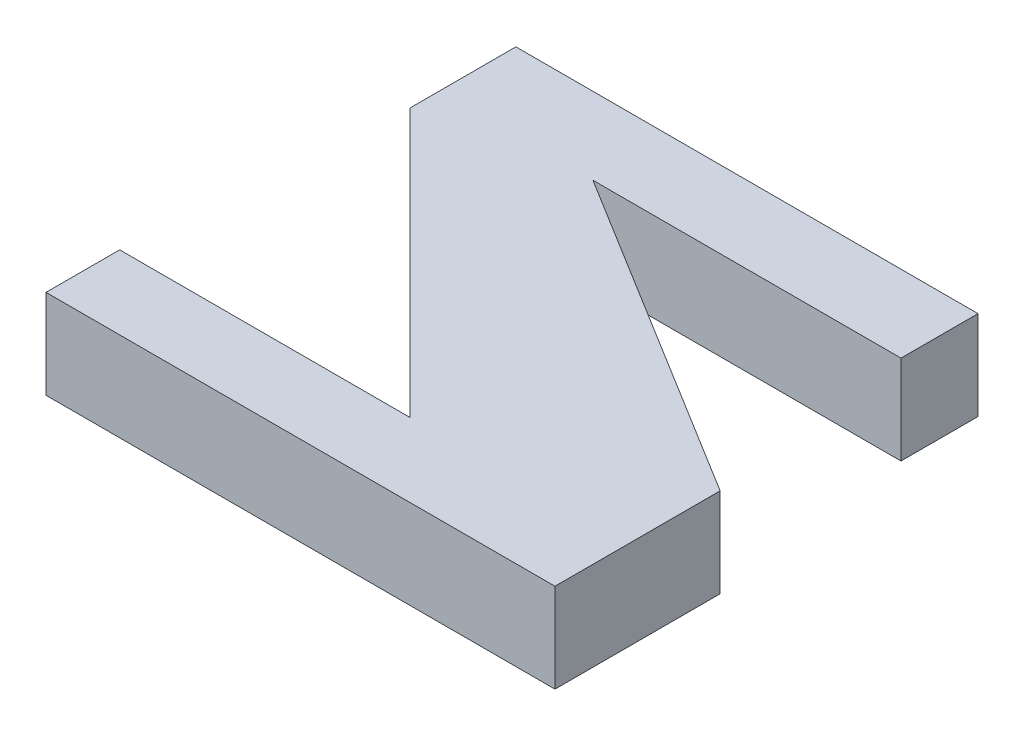
ISO-10303-21;
HEADER;
FILE_DESCRIPTION(('STEP AP214'),'2;1');
FILE_NAME('part.step','',(''),(''),'','','');
FILE_SCHEMA(('AUTOMOTIVE_DESIGN { 1 0 10303 214 1 1 1 1 }'));
ENDSEC;
DATA;
#1=APPLICATION_CONTEXT('core data for automotive mechanical design processes');
#2=APPLICATION_PROTOCOL_DEFINITION('international standard','automotive_design',2000,#1);
#3=PRODUCT_CONTEXT('',#1,'mechanical');
#4=PRODUCT('Part','Part','',(#3));
#5=PRODUCT_RELATED_PRODUCT_CATEGORY('part','',(#4));
#6=PRODUCT_DEFINITION_FORMATION('','',#4);
#7=PRODUCT_DEFINITION_CONTEXT('part definition',#1,'design');
#8=PRODUCT_DEFINITION('design','',#6,#7);
#9=PRODUCT_DEFINITION_SHAPE('','',#8);
#10=(LENGTH_UNIT() NAMED_UNIT(*) SI_UNIT(.MILLI.,.METRE.));
#11=(NAMED_UNIT(*) PLANE_ANGLE_UNIT() SI_UNIT($,.RADIAN.));
#12=(NAMED_UNIT(*) SI_UNIT($,.STERADIAN.) SOLID_ANGLE_UNIT());
#13=UNCERTAINTY_MEASURE_WITH_UNIT(LENGTH_MEASURE(1.E-05),#10,'distance_accuracy_value','');
#14=(GEOMETRIC_REPRESENTATION_CONTEXT(3) GLOBAL_UNCERTAINTY_ASSIGNED_CONTEXT((#13)) GLOBAL_UNIT_ASSIGNED_CONTEXT((#10,
#11,#12)) REPRESENTATION_CONTEXT('',''));
#15=CARTESIAN_POINT('',(0.,0.,0.));
#16=DIRECTION('',(0.,0.,1.));
#17=DIRECTION('',(1.,0.,0.));
#18=AXIS2_PLACEMENT_3D('',#15,#16,#17);
#19=CARTESIAN_POINT('',(0.,10.,8.63837574377922));
#20=DIRECTION('',(-1.,0.,0.));
#21=DIRECTION('',(0.,0.,1.));
#22=AXIS2_PLACEMENT_3D('',#19,#20,#21);
#23=PLANE('',#22);
#24=DIRECTION('',(0.,0.,-1.));
#25=VECTOR('',#24,1.);
#26=CARTESIAN_POINT('',(0.,0.,8.63837574377922));
#27=LINE('',#26,#25);
#28=CARTESIAN_POINT('',(0.,0.,8.63837574377922));
#29=VERTEX_POINT('',#28);
#30=CARTESIAN_POINT('',(0.,0.,0.));
#31=VERTEX_POINT('',#30);
#32=EDGE_CURVE('E141',#29,#31,#27,.T.);
#33=ORIENTED_EDGE('',*,*,#32,.T.);
#34=DIRECTION('',(0.,-1.,0.));
#35=VECTOR('',#34,1.);
#36=CARTESIAN_POINT('',(0.,10.,0.));
#37=LINE('',#36,#35);
#38=CARTESIAN_POINT('',(0.,10.,0.));
#39=VERTEX_POINT('',#38);
#40=EDGE_CURVE('E11',#39,#31,#37,.T.);
#41=ORIENTED_EDGE('',*,*,#40,.F.);
#42=DIRECTION('',(0.,0.,-1.));
#43=VECTOR('',#42,1.);
#44=CARTESIAN_POINT('',(0.,10.,8.63837574377922));
#45=LINE('',#44,#43);
#46=CARTESIAN_POINT('',(0.,10.,8.63837574377922));
#47=VERTEX_POINT('',#46);
#48=EDGE_CURVE('E159',#47,#39,#45,.T.);
#49=ORIENTED_EDGE('',*,*,#48,.F.);
#50=DIRECTION('',(0.,-1.,0.));
#51=VECTOR('',#50,1.);
#52=CARTESIAN_POINT('',(0.,10.,8.63837574377922));
#53=LINE('',#52,#51);
#54=EDGE_CURVE('E137',#47,#29,#53,.T.);
#55=ORIENTED_EDGE('',*,*,#54,.T.);
#56=EDGE_LOOP('',(#33,#41,#49,#55));
#57=FACE_BOUND('',#56,.T.);
#58=ADVANCED_FACE('F33',(#57),#23,.F.);
#59=CARTESIAN_POINT('',(0.,10.,0.));
#60=DIRECTION('',(0.,0.,1.));
#61=DIRECTION('',(1.,0.,0.));
#62=AXIS2_PLACEMENT_3D('',#59,#60,#61);
#63=PLANE('',#62);
#64=DIRECTION('',(-1.,0.,0.));
#65=VECTOR('',#64,1.);
#66=CARTESIAN_POINT('',(0.,0.,0.));
#67=LINE('',#66,#65);
#68=CARTESIAN_POINT('',(-51.8302544626754,0.,0.));
#69=VERTEX_POINT('',#68);
#70=EDGE_CURVE('E144',#31,#69,#67,.T.);
#71=ORIENTED_EDGE('',*,*,#70,.T.);
#72=DIRECTION('',(0.,-1.,0.));
#73=VECTOR('',#72,1.);
#74=CARTESIAN_POINT('',(-51.8302544626754,10.,0.));
#75=LINE('',#74,#73);
#76=CARTESIAN_POINT('',(-51.8302544626754,10.,0.));
#77=VERTEX_POINT('',#76);
#78=EDGE_CURVE('E41',#77,#69,#75,.T.);
#79=ORIENTED_EDGE('',*,*,#78,.F.);
#80=DIRECTION('',(-1.,0.,0.));
#81=VECTOR('',#80,1.);
#82=CARTESIAN_POINT('',(0.,10.,0.));
#83=LINE('',#82,#81);
#84=EDGE_CURVE('E98',#39,#77,#83,.T.);
#85=ORIENTED_EDGE('',*,*,#84,.F.);
#86=ORIENTED_EDGE('',*,*,#40,.T.);
#87=EDGE_LOOP('',(#71,#79,#85,#86));
#88=FACE_BOUND('',#87,.T.);
#89=ADVANCED_FACE('F208',(#88),#63,.F.);
#90=CARTESIAN_POINT('',(-51.8302544626754,10.,0.));
#91=DIRECTION('',(1.,0.,0.));
#92=DIRECTION('',(0.,0.,-1.));
#93=AXIS2_PLACEMENT_3D('',#90,#91,#92);
#94=PLANE('',#93);
#95=DIRECTION('',(0.,0.,1.));
#96=VECTOR('',#95,1.);
#97=CARTESIAN_POINT('',(-51.8302544626754,0.,0.));
#98=LINE('',#97,#96);
#99=CARTESIAN_POINT('',(-51.8302544626754,0.,11.8934158791163));
#100=VERTEX_POINT('',#99);
#101=EDGE_CURVE('E146',#69,#100,#98,.T.);
#102=ORIENTED_EDGE('',*,*,#101,.T.);
#103=DIRECTION('',(0.,-1.,0.));
#104=VECTOR('',#103,1.);
#105=CARTESIAN_POINT('',(-51.8302544626754,10.,11.8934158791163));
#106=LINE('',#105,#104);
#107=CARTESIAN_POINT('',(-51.8302544626754,10.,11.8934158791163));
#108=VERTEX_POINT('',#107);
#109=EDGE_CURVE('E172',#108,#100,#106,.T.);
#110=ORIENTED_EDGE('',*,*,#109,.F.);
#111=DIRECTION('',(0.,0.,1.));
#112=VECTOR('',#111,1.);
#113=CARTESIAN_POINT('',(-51.8302544626754,10.,0.));
#114=LINE('',#113,#112);
#115=EDGE_CURVE('E180',#77,#108,#114,.T.);
#116=ORIENTED_EDGE('',*,*,#115,.F.);
#117=ORIENTED_EDGE('',*,*,#78,.T.);
#118=EDGE_LOOP('',(#102,#110,#116,#117));
#119=FACE_BOUND('',#118,.T.);
#120=ADVANCED_FACE('F178',(#119),#94,.F.);
#121=CARTESIAN_POINT('',(-51.8302544626754,10.,11.8934158791163));
#122=DIRECTION('',(0.707106781186548,0.,-0.707106781186547));
#123=DIRECTION('',(-0.707106781186547,0.,-0.707106781186548));
#124=AXIS2_PLACEMENT_3D('',#121,#122,#123);
#125=PLANE('',#124);
#126=DIRECTION('',(0.707106781186547,0.,0.707106781186548));
#127=VECTOR('',#126,1.);
#128=CARTESIAN_POINT('',(-51.8302544626754,0.,11.8934158791163));
#129=LINE('',#128,#127);
#130=CARTESIAN_POINT('',(-21.7837301364868,0.,41.9399402053049));
#131=VERTEX_POINT('',#130);
#132=EDGE_CURVE('E148',#100,#131,#129,.T.);
#133=ORIENTED_EDGE('',*,*,#132,.T.);
#134=DIRECTION('',(0.,-1.,0.));
#135=VECTOR('',#134,1.);
#136=CARTESIAN_POINT('',(-21.7837301364868,10.,41.9399402053049));
#137=LINE('',#136,#135);
#138=CARTESIAN_POINT('',(-21.7837301364868,10.,41.9399402053049));
#139=VERTEX_POINT('',#138);
#140=EDGE_CURVE('E169',#139,#131,#137,.T.);
#141=ORIENTED_EDGE('',*,*,#140,.F.);
#142=DIRECTION('',(0.707106781186547,0.,0.707106781186548));
#143=VECTOR('',#142,1.);
#144=CARTESIAN_POINT('',(-51.8302544626754,10.,11.8934158791163));
#145=LINE('',#144,#143);
#146=EDGE_CURVE('E198',#108,#139,#145,.T.);
#147=ORIENTED_EDGE('',*,*,#146,.F.);
#148=ORIENTED_EDGE('',*,*,#109,.T.);
#149=EDGE_LOOP('',(#133,#141,#147,#148));
#150=FACE_BOUND('',#149,.T.);
#151=ADVANCED_FACE('F189',(#150),#125,.F.);
#152=CARTESIAN_POINT('',(-21.7837301364868,10.,41.9399402053049));
#153=DIRECTION('',(0.,0.,1.));
#154=DIRECTION('',(1.,0.,0.));
#155=AXIS2_PLACEMENT_3D('',#152,#153,#154);
#156=PLANE('',#155);
#157=DIRECTION('',(-1.,0.,0.));
#158=VECTOR('',#157,1.);
#159=CARTESIAN_POINT('',(-21.7837301364868,0.,41.9399402053049));
#160=LINE('',#159,#158);
#161=CARTESIAN_POINT('',(-54.3341314898577,0.,41.9399402053049));
#162=VERTEX_POINT('',#161);
#163=EDGE_CURVE('E150',#131,#162,#160,.T.);
#164=ORIENTED_EDGE('',*,*,#163,.T.);
#165=DIRECTION('',(0.,-1.,0.));
#166=VECTOR('',#165,1.);
#167=CARTESIAN_POINT('',(-54.3341314898577,10.,41.9399402053049));
#168=LINE('',#167,#166);
#169=CARTESIAN_POINT('',(-54.3341314898577,10.,41.9399402053049));
#170=VERTEX_POINT('',#169);
#171=EDGE_CURVE('E166',#170,#162,#168,.T.);
#172=ORIENTED_EDGE('',*,*,#171,.F.);
#173=DIRECTION('',(-1.,0.,0.));
#174=VECTOR('',#173,1.);
#175=CARTESIAN_POINT('',(-21.7837301364868,10.,41.9399402053049));
#176=LINE('',#175,#174);
#177=EDGE_CURVE('E195',#139,#170,#176,.T.);
#178=ORIENTED_EDGE('',*,*,#177,.F.);
#179=ORIENTED_EDGE('',*,*,#140,.T.);
#180=EDGE_LOOP('',(#164,#172,#178,#179));
#181=FACE_BOUND('',#180,.T.);
#182=ADVANCED_FACE('F193',(#181),#156,.F.);
#183=CARTESIAN_POINT('',(-54.3341314898577,10.,41.9399402053049));
#184=DIRECTION('',(1.,0.,0.));
#185=DIRECTION('',(0.,0.,-1.));
#186=AXIS2_PLACEMENT_3D('',#183,#184,#185);
#187=PLANE('',#186);
#188=DIRECTION('',(0.,0.,1.));
#189=VECTOR('',#188,1.);
#190=CARTESIAN_POINT('',(-54.3341314898577,0.,41.9399402053049));
#191=LINE('',#190,#189);
#192=CARTESIAN_POINT('',(-54.3341314898577,0.,50.2027343950068));
#193=VERTEX_POINT('',#192);
#194=EDGE_CURVE('E152',#162,#193,#191,.T.);
#195=ORIENTED_EDGE('',*,*,#194,.T.);
#196=DIRECTION('',(0.,-1.,0.));
#197=VECTOR('',#196,1.);
#198=CARTESIAN_POINT('',(-54.3341314898577,10.,50.2027343950068));
#199=LINE('',#198,#197);
#200=CARTESIAN_POINT('',(-54.3341314898577,10.,50.2027343950068));
#201=VERTEX_POINT('',#200);
#202=EDGE_CURVE('E163',#201,#193,#199,.T.);
#203=ORIENTED_EDGE('',*,*,#202,.F.);
#204=DIRECTION('',(0.,0.,1.));
#205=VECTOR('',#204,1.);
#206=CARTESIAN_POINT('',(-54.3341314898577,10.,41.9399402053049));
#207=LINE('',#206,#205);
#208=EDGE_CURVE('E197',#170,#201,#207,.T.);
#209=ORIENTED_EDGE('',*,*,#208,.F.);
#210=ORIENTED_EDGE('',*,*,#171,.T.);
#211=EDGE_LOOP('',(#195,#203,#209,#210));
#212=FACE_BOUND('',#211,.T.);
#213=ADVANCED_FACE('F220',(#212),#187,.F.);
#214=CARTESIAN_POINT('',(-54.3341314898577,10.,50.2027343950068));
#215=DIRECTION('',(0.,0.,-1.));
#216=DIRECTION('',(-1.,0.,0.));
#217=AXIS2_PLACEMENT_3D('',#214,#215,#216);
#218=PLANE('',#217);
#219=DIRECTION('',(1.,0.,0.));
#220=VECTOR('',#219,1.);
#221=CARTESIAN_POINT('',(-54.3341314898577,0.,50.2027343950068));
#222=LINE('',#221,#220);
#223=CARTESIAN_POINT('',(2.75426472990065,0.,50.2027343950068));
#224=VERTEX_POINT('',#223);
#225=EDGE_CURVE('E154',#193,#224,#222,.T.);
#226=ORIENTED_EDGE('',*,*,#225,.T.);
#227=DIRECTION('',(0.,-1.,0.));
#228=VECTOR('',#227,1.);
#229=CARTESIAN_POINT('',(2.75426472990065,10.,50.2027343950068));
#230=LINE('',#229,#228);
#231=CARTESIAN_POINT('',(2.75426472990065,10.,50.2027343950068));
#232=VERTEX_POINT('',#231);
#233=EDGE_CURVE('E132',#232,#224,#230,.T.);
#234=ORIENTED_EDGE('',*,*,#233,.F.);
#235=DIRECTION('',(1.,0.,0.));
#236=VECTOR('',#235,1.);
#237=CARTESIAN_POINT('',(-54.3341314898577,10.,50.2027343950068));
#238=LINE('',#237,#236);
#239=EDGE_CURVE('E123',#201,#232,#238,.T.);
#240=ORIENTED_EDGE('',*,*,#239,.F.);
#241=ORIENTED_EDGE('',*,*,#202,.T.);
#242=EDGE_LOOP('',(#226,#234,#240,#241));
#243=FACE_BOUND('',#242,.T.);
#244=ADVANCED_FACE('F223',(#243),#218,.F.);
#245=CARTESIAN_POINT('',(2.75426472990065,10.,50.2027343950068));
#246=DIRECTION('',(-1.,0.,0.));
#247=DIRECTION('',(0.,0.,1.));
#248=AXIS2_PLACEMENT_3D('',#245,#246,#247);
#249=PLANE('',#248);
#250=DIRECTION('',(0.,0.,-1.));
#251=VECTOR('',#250,1.);
#252=CARTESIAN_POINT('',(2.75426472990065,0.,50.2027343950068));
#253=LINE('',#252,#251);
#254=CARTESIAN_POINT('',(2.75426472990065,0.,31.6740443938572));
#255=VERTEX_POINT('',#254);
#256=EDGE_CURVE('E131',#224,#255,#253,.T.);
#257=ORIENTED_EDGE('',*,*,#256,.T.);
#258=DIRECTION('',(0.,-1.,0.));
#259=VECTOR('',#258,1.);
#260=CARTESIAN_POINT('',(2.75426472990065,10.,31.6740443938572));
#261=LINE('',#260,#259);
#262=CARTESIAN_POINT('',(2.75426472990065,10.,31.6740443938572));
#263=VERTEX_POINT('',#262);
#264=EDGE_CURVE('E128',#263,#255,#261,.T.);
#265=ORIENTED_EDGE('',*,*,#264,.F.);
#266=DIRECTION('',(0.,0.,-1.));
#267=VECTOR('',#266,1.);
#268=CARTESIAN_POINT('',(2.75426472990065,10.,50.2027343950068));
#269=LINE('',#268,#267);
#270=EDGE_CURVE('E117',#232,#263,#269,.T.);
#271=ORIENTED_EDGE('',*,*,#270,.F.);
#272=ORIENTED_EDGE('',*,*,#233,.T.);
#273=EDGE_LOOP('',(#257,#265,#271,#272));
#274=FACE_BOUND('',#273,.T.);
#275=ADVANCED_FACE('F129',(#274),#249,.F.);
#276=CARTESIAN_POINT('',(2.75426472990065,10.,31.6740443938572));
#277=DIRECTION('',(-0.525371298050495,0.,0.850873080538301));
#278=DIRECTION('',(0.850873080538301,0.,0.525371298050495));
#279=AXIS2_PLACEMENT_3D('',#276,#277,#278);
#280=PLANE('',#279);
#281=DIRECTION('',(-0.850873080538301,0.,-0.525371298050495));
#282=VECTOR('',#281,1.);
#283=CARTESIAN_POINT('',(2.75426472990065,0.,31.6740443938572));
#284=LINE('',#283,#282);
#285=CARTESIAN_POINT('',(-34.5535029751169,0.,8.63837574377922));
#286=VERTEX_POINT('',#285);
#287=EDGE_CURVE('E84',#255,#286,#284,.T.);
#288=ORIENTED_EDGE('',*,*,#287,.T.);
#289=DIRECTION('',(0.,-1.,0.));
#290=VECTOR('',#289,1.);
#291=CARTESIAN_POINT('',(-34.5535029751169,10.,8.63837574377922));
#292=LINE('',#291,#290);
#293=CARTESIAN_POINT('',(-34.5535029751169,10.,8.63837574377922));
#294=VERTEX_POINT('',#293);
#295=EDGE_CURVE('E133',#294,#286,#292,.T.);
#296=ORIENTED_EDGE('',*,*,#295,.F.);
#297=DIRECTION('',(-0.850873080538301,0.,-0.525371298050495));
#298=VECTOR('',#297,1.);
#299=CARTESIAN_POINT('',(2.75426472990065,10.,31.6740443938572));
#300=LINE('',#299,#298);
#301=EDGE_CURVE('E121',#263,#294,#300,.T.);
#302=ORIENTED_EDGE('',*,*,#301,.F.);
#303=ORIENTED_EDGE('',*,*,#264,.T.);
#304=EDGE_LOOP('',(#288,#296,#302,#303));
#305=FACE_BOUND('',#304,.T.);
#306=ADVANCED_FACE('F135',(#305),#280,.F.);
#307=CARTESIAN_POINT('',(-34.5535029751169,10.,8.63837574377922));
#308=DIRECTION('',(0.,0.,-1.));
#309=DIRECTION('',(-1.,0.,0.));
#310=AXIS2_PLACEMENT_3D('',#307,#308,#309);
#311=PLANE('',#310);
#312=DIRECTION('',(1.,0.,0.));
#313=VECTOR('',#312,1.);
#314=CARTESIAN_POINT('',(-34.5535029751169,0.,8.63837574377922));
#315=LINE('',#314,#313);
#316=EDGE_CURVE('E90',#286,#29,#315,.T.);
#317=ORIENTED_EDGE('',*,*,#316,.T.);
#318=ORIENTED_EDGE('',*,*,#54,.F.);
#319=DIRECTION('',(1.,0.,0.));
#320=VECTOR('',#319,1.);
#321=CARTESIAN_POINT('',(-34.5535029751169,10.,8.63837574377922));
#322=LINE('',#321,#320);
#323=EDGE_CURVE('E49',#294,#47,#322,.T.);
#324=ORIENTED_EDGE('',*,*,#323,.F.);
#325=ORIENTED_EDGE('',*,*,#295,.T.);
#326=EDGE_LOOP('',(#317,#318,#324,#325));
#327=FACE_BOUND('',#326,.T.);
#328=ADVANCED_FACE('F232',(#327),#311,.F.);
#329=CARTESIAN_POINT('',(0.,10.,0.));
#330=DIRECTION('',(0.,1.,0.));
#331=DIRECTION('',(0.,0.,1.));
#332=AXIS2_PLACEMENT_3D('',#329,#330,#331);
#333=PLANE('',#332);
#334=ORIENTED_EDGE('',*,*,#48,.T.);
#335=ORIENTED_EDGE('',*,*,#84,.T.);
#336=ORIENTED_EDGE('',*,*,#115,.T.);
#337=ORIENTED_EDGE('',*,*,#146,.T.);
#338=ORIENTED_EDGE('',*,*,#177,.T.);
#339=ORIENTED_EDGE('',*,*,#208,.T.);
#340=ORIENTED_EDGE('',*,*,#239,.T.);
#341=ORIENTED_EDGE('',*,*,#270,.T.);
#342=ORIENTED_EDGE('',*,*,#301,.T.);
#343=ORIENTED_EDGE('',*,*,#323,.T.);
#344=EDGE_LOOP('',(#334,#335,#336,#337,#338,#339,#340,#341,#342,#343));
#345=FACE_BOUND('',#344,.T.);
#346=ADVANCED_FACE('F119',(#345),#333,.T.);
#347=CARTESIAN_POINT('',(0.,0.,0.));
#348=DIRECTION('',(0.,1.,0.));
#349=DIRECTION('',(0.,0.,1.));
#350=AXIS2_PLACEMENT_3D('',#347,#348,#349);
#351=PLANE('',#350);
#352=ORIENTED_EDGE('',*,*,#32,.F.);
#353=ORIENTED_EDGE('',*,*,#316,.F.);
#354=ORIENTED_EDGE('',*,*,#287,.F.);
#355=ORIENTED_EDGE('',*,*,#256,.F.);
#356=ORIENTED_EDGE('',*,*,#225,.F.);
#357=ORIENTED_EDGE('',*,*,#194,.F.);
#358=ORIENTED_EDGE('',*,*,#163,.F.);
#359=ORIENTED_EDGE('',*,*,#132,.F.);
#360=ORIENTED_EDGE('',*,*,#101,.F.);
#361=ORIENTED_EDGE('',*,*,#70,.F.);
#362=EDGE_LOOP('',(#352,#353,#354,#355,#356,#357,#358,#359,#360,#361));
#363=FACE_BOUND('',#362,.T.);
#364=ADVANCED_FACE('F184',(#363),#351,.F.);
#365=CLOSED_SHELL('',(#58,#89,#120,#151,#182,#213,#244,#275,#306,#328,#346,#364));
#366=MANIFOLD_SOLID_BREP('B2',#365);
#367=ADVANCED_BREP_SHAPE_REPRESENTATION('',(#18,#366),#14);
#368=SHAPE_DEFINITION_REPRESENTATION(#9,#367);
ENDSEC;
END-ISO-10303-21;
